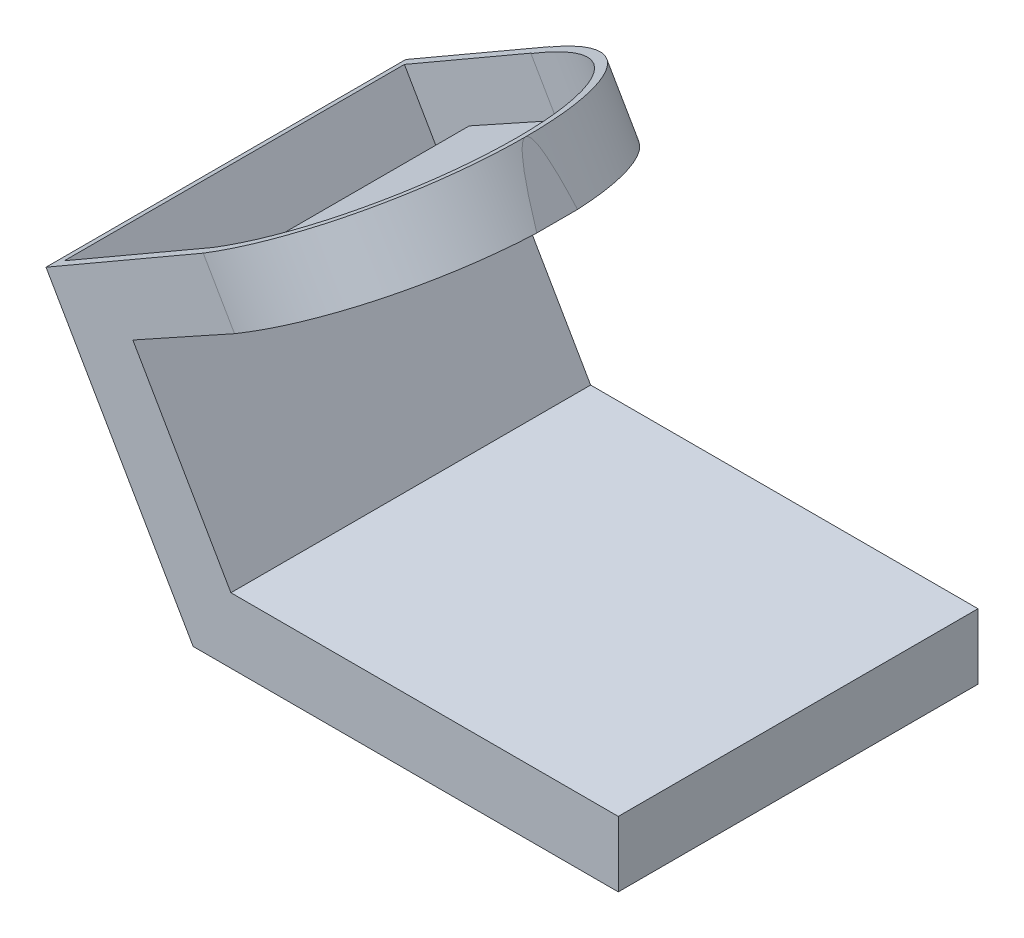
ISO-10303-21;
HEADER;
FILE_DESCRIPTION(('STEP AP214'),'2;1');
FILE_NAME('part.step','',(''),(''),'','','');
FILE_SCHEMA(('AUTOMOTIVE_DESIGN { 1 0 10303 214 1 1 1 1 }'));
ENDSEC;
DATA;
#1=APPLICATION_CONTEXT('core data for automotive mechanical design processes');
#2=APPLICATION_PROTOCOL_DEFINITION('international standard','automotive_design',2000,#1);
#3=PRODUCT_CONTEXT('',#1,'mechanical');
#4=PRODUCT('Part','Part','',(#3));
#5=PRODUCT_RELATED_PRODUCT_CATEGORY('part','',(#4));
#6=PRODUCT_DEFINITION_FORMATION('','',#4);
#7=PRODUCT_DEFINITION_CONTEXT('part definition',#1,'design');
#8=PRODUCT_DEFINITION('design','',#6,#7);
#9=PRODUCT_DEFINITION_SHAPE('','',#8);
#10=(LENGTH_UNIT() NAMED_UNIT(*) SI_UNIT(.MILLI.,.METRE.));
#11=(NAMED_UNIT(*) PLANE_ANGLE_UNIT() SI_UNIT($,.RADIAN.));
#12=(NAMED_UNIT(*) SI_UNIT($,.STERADIAN.) SOLID_ANGLE_UNIT());
#13=UNCERTAINTY_MEASURE_WITH_UNIT(LENGTH_MEASURE(1.E-05),#10,'distance_accuracy_value','');
#14=(GEOMETRIC_REPRESENTATION_CONTEXT(3) GLOBAL_UNCERTAINTY_ASSIGNED_CONTEXT((#13)) GLOBAL_UNIT_ASSIGNED_CONTEXT((#10,
#11,#12)) REPRESENTATION_CONTEXT('',''));
#15=CARTESIAN_POINT('',(0.,0.,0.));
#16=DIRECTION('',(0.,0.,1.));
#17=DIRECTION('',(1.,0.,0.));
#18=AXIS2_PLACEMENT_3D('',#15,#16,#17);
#19=CARTESIAN_POINT('',(46.7986928011498,130.9422863406,110.));
#20=DIRECTION('',(-0.874743269355894,-0.484586641083472,0.));
#21=DIRECTION('',(0.484586641083472,-0.874743269355894,0.));
#22=AXIS2_PLACEMENT_3D('',#19,#20,#21);
#23=PLANE('',#22);
#24=CARTESIAN_POINT('',(1551.95620112829,-2586.06699147574,55.1869746386134));
#25=DIRECTION('',(-0.874743269355894,-0.484586641083472,0.));
#26=DIRECTION('',(-0.484586641083472,0.874743269355894,0.));
#27=AXIS2_PLACEMENT_3D('',#24,#25,#26);
#28=ELLIPSE('',#27,3106.06479980918,55.);
#29=CARTESIAN_POINT('',(56.4904256228193,113.447420953482,48.9555521950042));
#30=VERTEX_POINT('',#29);
#31=CARTESIAN_POINT('',(46.7986928011498,130.9422863406,55.1869746386134));
#32=VERTEX_POINT('',#31);
#33=EDGE_CURVE('E343',#30,#32,#28,.F.);
#34=ORIENTED_EDGE('',*,*,#33,.T.);
#35=CARTESIAN_POINT('',(56.4904256228193,113.447420953482,61.4183970822225));
#36=VERTEX_POINT('',#35);
#37=EDGE_CURVE('E338',#32,#36,#28,.F.);
#38=ORIENTED_EDGE('',*,*,#37,.T.);
#39=DIRECTION('',(0.,0.,-1.));
#40=VECTOR('',#39,1.);
#41=CARTESIAN_POINT('',(56.4904256228193,113.447420953482,110.));
#42=LINE('',#41,#40);
#43=EDGE_CURVE('E394',#36,#30,#42,.T.);
#44=ORIENTED_EDGE('',*,*,#43,.T.);
#45=EDGE_LOOP('',(#34,#38,#44));
#46=FACE_BOUND('',#45,.T.);
#47=ADVANCED_FACE('F45',(#46),#23,.F.);
#48=CARTESIAN_POINT('',(0.,0.,110.));
#49=DIRECTION('',(0.866025403784436,0.500000000000004,0.));
#50=DIRECTION('',(-0.500000000000004,0.866025403784436,0.));
#51=AXIS2_PLACEMENT_3D('',#48,#49,#50);
#52=PLANE('',#51);
#53=DIRECTION('',(0.500000000000004,-0.866025403784436,0.));
#54=VECTOR('',#53,1.);
#55=CARTESIAN_POINT('',(0.,0.,0.));
#56=LINE('',#55,#54);
#57=CARTESIAN_POINT('',(-45.0000000000004,77.9422863405993,0.));
#58=VERTEX_POINT('',#57);
#59=CARTESIAN_POINT('',(0.,0.,0.));
#60=VERTEX_POINT('',#59);
#61=EDGE_CURVE('E369',#58,#60,#56,.T.);
#62=ORIENTED_EDGE('',*,*,#61,.T.);
#63=DIRECTION('',(0.,0.,-1.));
#64=VECTOR('',#63,1.);
#65=CARTESIAN_POINT('',(0.,0.,110.));
#66=LINE('',#65,#64);
#67=CARTESIAN_POINT('',(0.,0.,110.));
#68=VERTEX_POINT('',#67);
#69=EDGE_CURVE('E414',#68,#60,#66,.T.);
#70=ORIENTED_EDGE('',*,*,#69,.F.);
#71=DIRECTION('',(0.500000000000004,-0.866025403784436,0.));
#72=VECTOR('',#71,1.);
#73=CARTESIAN_POINT('',(0.,0.,110.));
#74=LINE('',#73,#72);
#75=CARTESIAN_POINT('',(-45.0000000000004,77.9422863405993,110.));
#76=VERTEX_POINT('',#75);
#77=EDGE_CURVE('E344',#76,#68,#74,.T.);
#78=ORIENTED_EDGE('',*,*,#77,.F.);
#79=DIRECTION('',(0.,0.,-1.));
#80=VECTOR('',#79,1.);
#81=CARTESIAN_POINT('',(-45.0000000000004,77.9422863405993,110.));
#82=LINE('',#81,#80);
#83=EDGE_CURVE('E368',#76,#58,#82,.T.);
#84=ORIENTED_EDGE('',*,*,#83,.T.);
#85=EDGE_LOOP('',(#62,#70,#78,#84));
#86=FACE_BOUND('',#85,.T.);
#87=ADVANCED_FACE('F47',(#86),#52,.F.);
#88=CARTESIAN_POINT('',(0.,0.,110.));
#89=DIRECTION('',(0.,1.,0.));
#90=DIRECTION('',(0.,0.,1.));
#91=AXIS2_PLACEMENT_3D('',#88,#89,#90);
#92=PLANE('',#91);
#93=DIRECTION('',(1.,0.,0.));
#94=VECTOR('',#93,1.);
#95=CARTESIAN_POINT('',(0.,0.,0.));
#96=LINE('',#95,#94);
#97=CARTESIAN_POINT('',(130.,0.,0.));
#98=VERTEX_POINT('',#97);
#99=EDGE_CURVE('E373',#60,#98,#96,.T.);
#100=ORIENTED_EDGE('',*,*,#99,.T.);
#101=DIRECTION('',(0.,0.,-1.));
#102=VECTOR('',#101,1.);
#103=CARTESIAN_POINT('',(130.,0.,110.));
#104=LINE('',#103,#102);
#105=CARTESIAN_POINT('',(130.,0.,110.));
#106=VERTEX_POINT('',#105);
#107=EDGE_CURVE('E410',#106,#98,#104,.T.);
#108=ORIENTED_EDGE('',*,*,#107,.F.);
#109=DIRECTION('',(1.,0.,0.));
#110=VECTOR('',#109,1.);
#111=CARTESIAN_POINT('',(0.,0.,110.));
#112=LINE('',#111,#110);
#113=EDGE_CURVE('E348',#68,#106,#112,.T.);
#114=ORIENTED_EDGE('',*,*,#113,.F.);
#115=ORIENTED_EDGE('',*,*,#69,.T.);
#116=EDGE_LOOP('',(#100,#108,#114,#115));
#117=FACE_BOUND('',#116,.T.);
#118=ADVANCED_FACE('F467',(#117),#92,.F.);
#119=CARTESIAN_POINT('',(130.,0.,110.));
#120=DIRECTION('',(-1.,0.,0.));
#121=DIRECTION('',(0.,0.,1.));
#122=AXIS2_PLACEMENT_3D('',#119,#120,#121);
#123=PLANE('',#122);
#124=DIRECTION('',(0.,1.,0.));
#125=VECTOR('',#124,1.);
#126=CARTESIAN_POINT('',(130.,0.,0.));
#127=LINE('',#126,#125);
#128=CARTESIAN_POINT('',(130.,20.,0.));
#129=VERTEX_POINT('',#128);
#130=EDGE_CURVE('E376',#98,#129,#127,.T.);
#131=ORIENTED_EDGE('',*,*,#130,.T.);
#132=DIRECTION('',(0.,0.,-1.));
#133=VECTOR('',#132,1.);
#134=CARTESIAN_POINT('',(130.,20.,110.));
#135=LINE('',#134,#133);
#136=CARTESIAN_POINT('',(130.,20.,110.));
#137=VERTEX_POINT('',#136);
#138=EDGE_CURVE('E406',#137,#129,#135,.T.);
#139=ORIENTED_EDGE('',*,*,#138,.F.);
#140=DIRECTION('',(0.,1.,0.));
#141=VECTOR('',#140,1.);
#142=CARTESIAN_POINT('',(130.,0.,110.));
#143=LINE('',#142,#141);
#144=EDGE_CURVE('E352',#106,#137,#143,.T.);
#145=ORIENTED_EDGE('',*,*,#144,.F.);
#146=ORIENTED_EDGE('',*,*,#107,.T.);
#147=EDGE_LOOP('',(#131,#139,#145,#146));
#148=FACE_BOUND('',#147,.T.);
#149=ADVANCED_FACE('F464',(#148),#123,.F.);
#150=CARTESIAN_POINT('',(130.,20.,110.));
#151=DIRECTION('',(0.,-1.,0.));
#152=DIRECTION('',(1.,0.,0.));
#153=AXIS2_PLACEMENT_3D('',#150,#151,#152);
#154=PLANE('',#153);
#155=DIRECTION('',(-1.,0.,0.));
#156=VECTOR('',#155,1.);
#157=CARTESIAN_POINT('',(130.,20.,0.));
#158=LINE('',#157,#156);
#159=CARTESIAN_POINT('',(11.5470053837925,20.,0.));
#160=VERTEX_POINT('',#159);
#161=EDGE_CURVE('E379',#129,#160,#158,.T.);
#162=ORIENTED_EDGE('',*,*,#161,.T.);
#163=DIRECTION('',(0.,0.,-1.));
#164=VECTOR('',#163,1.);
#165=CARTESIAN_POINT('',(11.5470053837925,20.,110.));
#166=LINE('',#165,#164);
#167=CARTESIAN_POINT('',(11.5470053837925,20.,110.));
#168=VERTEX_POINT('',#167);
#169=EDGE_CURVE('E402',#168,#160,#166,.T.);
#170=ORIENTED_EDGE('',*,*,#169,.F.);
#171=DIRECTION('',(-1.,0.,0.));
#172=VECTOR('',#171,1.);
#173=CARTESIAN_POINT('',(130.,20.,110.));
#174=LINE('',#173,#172);
#175=EDGE_CURVE('E355',#137,#168,#174,.T.);
#176=ORIENTED_EDGE('',*,*,#175,.F.);
#177=ORIENTED_EDGE('',*,*,#138,.T.);
#178=EDGE_LOOP('',(#162,#170,#176,#177));
#179=FACE_BOUND('',#178,.T.);
#180=ADVANCED_FACE('F460',(#179),#154,.F.);
#181=CARTESIAN_POINT('',(11.5470053837925,20.,110.));
#182=DIRECTION('',(-0.866025403784436,-0.500000000000005,0.));
#183=DIRECTION('',(0.500000000000005,-0.866025403784436,0.));
#184=AXIS2_PLACEMENT_3D('',#181,#182,#183);
#185=PLANE('',#184);
#186=DIRECTION('',(-0.500000000000005,0.866025403784436,0.));
#187=VECTOR('',#186,1.);
#188=CARTESIAN_POINT('',(11.5470053837925,20.,0.));
#189=LINE('',#188,#187);
#190=CARTESIAN_POINT('',(-18.4394568185094,71.93807607363,0.));
#191=VERTEX_POINT('',#190);
#192=EDGE_CURVE('E382',#160,#191,#189,.T.);
#193=ORIENTED_EDGE('',*,*,#192,.T.);
#194=DIRECTION('',(0.,0.,-1.));
#195=VECTOR('',#194,1.);
#196=CARTESIAN_POINT('',(-18.4394568185094,71.93807607363,110.));
#197=LINE('',#196,#195);
#198=CARTESIAN_POINT('',(-18.4394568185094,71.93807607363,110.));
#199=VERTEX_POINT('',#198);
#200=EDGE_CURVE('E398',#199,#191,#197,.T.);
#201=ORIENTED_EDGE('',*,*,#200,.F.);
#202=DIRECTION('',(-0.500000000000005,0.866025403784436,0.));
#203=VECTOR('',#202,1.);
#204=CARTESIAN_POINT('',(11.5470053837925,20.,110.));
#205=LINE('',#204,#203);
#206=EDGE_CURVE('E358',#168,#199,#205,.T.);
#207=ORIENTED_EDGE('',*,*,#206,.F.);
#208=ORIENTED_EDGE('',*,*,#169,.T.);
#209=EDGE_LOOP('',(#193,#201,#207,#208));
#210=FACE_BOUND('',#209,.T.);
#211=ADVANCED_FACE('F455',(#210),#185,.F.);
#212=CARTESIAN_POINT('',(56.4904256228193,113.447420953482,110.));
#213=DIRECTION('',(-0.484586641083472,0.874743269355894,0.));
#214=DIRECTION('',(-0.874743269355894,-0.484586641083472,0.));
#215=AXIS2_PLACEMENT_3D('',#212,#213,#214);
#216=PLANE('',#215);
#217=CARTESIAN_POINT('',(8.39408348075906,86.8032092132942,55.095));
#218=DIRECTION('',(-0.484586641083472,0.874743269355894,0.));
#219=DIRECTION('',(-0.874743269355894,-0.484586641083472,0.));
#220=AXIS2_PLACEMENT_3D('',#217,#218,#219);
#221=CIRCLE('',#220,9.5);
#222=CARTESIAN_POINT('',(0.0840224218780702,82.1996361230012,55.095));
#223=VERTEX_POINT('',#222);
#224=EDGE_CURVE('E301',#223,#223,#221,.T.);
#225=ORIENTED_EDGE('',*,*,#224,.T.);
#226=EDGE_LOOP('',(#225));
#227=FACE_BOUND('',#226,.T.);
#228=ORIENTED_EDGE('',*,*,#43,.F.);
#229=CARTESIAN_POINT('',(8.68183678168936,86.962617591093,55.1869746386134));
#230=DIRECTION('',(-0.484586641083472,0.874743269355894,0.));
#231=DIRECTION('',(-0.874743269355894,-0.484586641083472,0.));
#232=AXIS2_PLACEMENT_3D('',#229,#230,#231);
#233=ELLIPSE('',#232,55.0086246045841,55.);
#234=CARTESIAN_POINT('',(12.6461411029082,89.1587464240324,110.));
#235=VERTEX_POINT('',#234);
#236=EDGE_CURVE('E334',#36,#235,#233,.F.);
#237=ORIENTED_EDGE('',*,*,#236,.T.);
#238=DIRECTION('',(0.874743269355894,0.484586641083472,0.));
#239=VECTOR('',#238,1.);
#240=CARTESIAN_POINT('',(56.4904256228193,113.447420953482,110.));
#241=LINE('',#240,#239);
#242=EDGE_CURVE('E361',#199,#235,#241,.T.);
#243=ORIENTED_EDGE('',*,*,#242,.F.);
#244=ORIENTED_EDGE('',*,*,#200,.T.);
#245=DIRECTION('',(0.874743269355894,0.484586641083472,0.));
#246=VECTOR('',#245,1.);
#247=CARTESIAN_POINT('',(56.4904256228193,113.447420953482,0.));
#248=LINE('',#247,#246);
#249=CARTESIAN_POINT('',(8.68183678168936,86.9626175910931,0.));
#250=VERTEX_POINT('',#249);
#251=EDGE_CURVE('E385',#191,#250,#248,.T.);
#252=ORIENTED_EDGE('',*,*,#251,.T.);
#253=DIRECTION('',(0.,0.,1.));
#254=VECTOR('',#253,1.);
#255=CARTESIAN_POINT('',(8.68183678169064,86.9626175910937,110.000000000001));
#256=LINE('',#255,#254);
#257=CARTESIAN_POINT('',(8.68183678168938,86.962617591093,0.186974638613363));
#258=VERTEX_POINT('',#257);
#259=EDGE_CURVE('E70',#250,#258,#256,.T.);
#260=ORIENTED_EDGE('',*,*,#259,.T.);
#261=EDGE_CURVE('E339',#258,#30,#233,.F.);
#262=ORIENTED_EDGE('',*,*,#261,.T.);
#263=EDGE_LOOP('',(#228,#237,#243,#244,#252,#260,#262));
#264=FACE_BOUND('',#263,.T.);
#265=ADVANCED_FACE('F443',(#227,#264),#216,.F.);
#266=CARTESIAN_POINT('',(-45.0000000000004,77.9422863405993,110.));
#267=DIRECTION('',(0.500000000000004,-0.866025403784436,0.));
#268=DIRECTION('',(0.866025403784436,0.500000000000004,0.));
#269=AXIS2_PLACEMENT_3D('',#266,#267,#268);
#270=PLANE('',#269);
#271=CARTESIAN_POINT('',(-0.832704406994143,103.442286340599,55.1869746386134));
#272=DIRECTION('',(0.500000000000004,-0.866025403784436,0.));
#273=DIRECTION('',(0.866025403784436,0.500000000000004,0.));
#274=AXIS2_PLACEMENT_3D('',#271,#272,#273);
#275=CIRCLE('',#274,52.);
#276=CARTESIAN_POINT('',(2.98276439450761,105.645148280231,107.));
#277=VERTEX_POINT('',#276);
#278=CARTESIAN_POINT('',(44.2002091828874,129.442051124111,55.4081641689637));
#279=VERTEX_POINT('',#278);
#280=EDGE_CURVE('E250',#277,#279,#275,.F.);
#281=ORIENTED_EDGE('',*,*,#280,.F.);
#282=DIRECTION('',(-0.866025403784436,-0.500000000000004,0.));
#283=VECTOR('',#282,1.);
#284=CARTESIAN_POINT('',(-45.0000000000004,77.9422863405993,107.));
#285=LINE('',#284,#283);
#286=CARTESIAN_POINT('',(-42.4019237886471,79.4422863405993,107.));
#287=VERTEX_POINT('',#286);
#288=EDGE_CURVE('E231',#277,#287,#285,.T.);
#289=ORIENTED_EDGE('',*,*,#288,.T.);
#290=DIRECTION('',(0.,0.,-1.));
#291=VECTOR('',#290,1.);
#292=CARTESIAN_POINT('',(-42.4019237886471,79.4422863405993,110.));
#293=LINE('',#292,#291);
#294=CARTESIAN_POINT('',(-42.4019237886471,79.4422863405993,3.));
#295=VERTEX_POINT('',#294);
#296=EDGE_CURVE('E223',#287,#295,#293,.T.);
#297=ORIENTED_EDGE('',*,*,#296,.T.);
#298=DIRECTION('',(-0.866025403784436,-0.500000000000004,0.));
#299=VECTOR('',#298,1.);
#300=CARTESIAN_POINT('',(-45.0000000000004,77.9422863405993,3.));
#301=LINE('',#300,#299);
#302=CARTESIAN_POINT('',(-3.43078061834741,101.942286340599,3.));
#303=VERTEX_POINT('',#302);
#304=EDGE_CURVE('E246',#303,#295,#301,.T.);
#305=ORIENTED_EDGE('',*,*,#304,.F.);
#306=DIRECTION('',(0.,0.,-1.));
#307=VECTOR('',#306,1.);
#308=CARTESIAN_POINT('',(-3.4307806183462,101.9422863406,109.999999999999));
#309=LINE('',#308,#307);
#310=CARTESIAN_POINT('',(-3.43078061834741,101.942286340599,3.27358522894373));
#311=VERTEX_POINT('',#310);
#312=EDGE_CURVE('E251',#311,#303,#309,.T.);
#313=ORIENTED_EDGE('',*,*,#312,.F.);
#314=CARTESIAN_POINT('',(-0.832704406994143,103.442286340599,55.1869746386134));
#315=DIRECTION('',(0.500000000000004,-0.866025403784436,0.));
#316=DIRECTION('',(0.866025403784436,0.500000000000004,0.));
#317=AXIS2_PLACEMENT_3D('',#314,#315,#316);
#318=CIRCLE('',#317,52.);
#319=CARTESIAN_POINT('',(44.2002091828877,129.44205112411,54.9657851082632));
#320=VERTEX_POINT('',#319);
#321=EDGE_CURVE('E237',#320,#311,#318,.F.);
#322=ORIENTED_EDGE('',*,*,#321,.F.);
#323=DIRECTION('',(0.,0.,-1.));
#324=VECTOR('',#323,1.);
#325=CARTESIAN_POINT('',(44.2002091828874,129.442051124111,110.));
#326=LINE('',#325,#324);
#327=EDGE_CURVE('E201',#279,#320,#326,.T.);
#328=ORIENTED_EDGE('',*,*,#327,.F.);
#329=EDGE_LOOP('',(#281,#289,#297,#305,#313,#322,#328));
#330=FACE_BOUND('',#329,.T.);
#331=DIRECTION('',(-0.866025403784436,-0.500000000000004,0.));
#332=VECTOR('',#331,1.);
#333=CARTESIAN_POINT('',(-45.0000000000004,77.9422863405993,110.));
#334=LINE('',#333,#332);
#335=CARTESIAN_POINT('',(3.09147551357442,105.707912674088,110.));
#336=VERTEX_POINT('',#335);
#337=EDGE_CURVE('E365',#336,#76,#334,.T.);
#338=ORIENTED_EDGE('',*,*,#337,.F.);
#339=CARTESIAN_POINT('',(-0.832704406994143,103.442286340599,55.1869746386134));
#340=DIRECTION('',(0.500000000000004,-0.866025403784436,0.));
#341=DIRECTION('',(0.866025403784436,0.500000000000004,0.));
#342=AXIS2_PLACEMENT_3D('',#339,#340,#341);
#343=CIRCLE('',#342,55.);
#344=EDGE_CURVE('E329',#336,#32,#343,.F.);
#345=ORIENTED_EDGE('',*,*,#344,.T.);
#346=CARTESIAN_POINT('',(-0.832704406994136,103.442286340599,0.186974638613363));
#347=VERTEX_POINT('',#346);
#348=EDGE_CURVE('E333',#32,#347,#343,.F.);
#349=ORIENTED_EDGE('',*,*,#348,.T.);
#350=DIRECTION('',(0.,0.,-1.));
#351=VECTOR('',#350,1.);
#352=CARTESIAN_POINT('',(-0.83270440699288,103.4422863406,109.999999999999));
#353=LINE('',#352,#351);
#354=CARTESIAN_POINT('',(-0.832704406994171,103.442286340599,0.));
#355=VERTEX_POINT('',#354);
#356=EDGE_CURVE('E323',#347,#355,#353,.T.);
#357=ORIENTED_EDGE('',*,*,#356,.T.);
#358=DIRECTION('',(-0.866025403784436,-0.500000000000004,0.));
#359=VECTOR('',#358,1.);
#360=CARTESIAN_POINT('',(-45.0000000000004,77.9422863405993,0.));
#361=LINE('',#360,#359);
#362=EDGE_CURVE('E349',#355,#58,#361,.T.);
#363=ORIENTED_EDGE('',*,*,#362,.T.);
#364=ORIENTED_EDGE('',*,*,#83,.F.);
#365=EDGE_LOOP('',(#338,#345,#349,#357,#363,#364));
#366=FACE_BOUND('',#365,.T.);
#367=ADVANCED_FACE('F426',(#330,#366),#270,.F.);
#368=CARTESIAN_POINT('',(0.,0.,110.));
#369=DIRECTION('',(0.,0.,-1.));
#370=DIRECTION('',(-1.,0.,0.));
#371=AXIS2_PLACEMENT_3D('',#368,#369,#370);
#372=PLANE('',#371);
#373=ORIENTED_EDGE('',*,*,#242,.T.);
#374=DIRECTION('',(-0.500000000000004,0.866025403784436,0.));
#375=VECTOR('',#374,1.);
#376=CARTESIAN_POINT('',(30.5914755135746,58.0765154659443,110.));
#377=LINE('',#376,#375);
#378=EDGE_CURVE('E11',#235,#336,#377,.T.);
#379=ORIENTED_EDGE('',*,*,#378,.T.);
#380=ORIENTED_EDGE('',*,*,#337,.T.);
#381=ORIENTED_EDGE('',*,*,#77,.T.);
#382=ORIENTED_EDGE('',*,*,#113,.T.);
#383=ORIENTED_EDGE('',*,*,#144,.T.);
#384=ORIENTED_EDGE('',*,*,#175,.T.);
#385=ORIENTED_EDGE('',*,*,#206,.T.);
#386=EDGE_LOOP('',(#373,#379,#380,#381,#382,#383,#384,#385));
#387=FACE_BOUND('',#386,.T.);
#388=ADVANCED_FACE('F437',(#387),#372,.F.);
#389=CARTESIAN_POINT('',(0.,0.,0.));
#390=DIRECTION('',(0.,0.,-1.));
#391=DIRECTION('',(-1.,0.,0.));
#392=AXIS2_PLACEMENT_3D('',#389,#390,#391);
#393=PLANE('',#392);
#394=DIRECTION('',(-0.500000000000005,0.866025403784436,0.));
#395=VECTOR('',#394,1.);
#396=CARTESIAN_POINT('',(44.1672955930062,25.5000000000002,0.));
#397=LINE('',#396,#395);
#398=EDGE_CURVE('E55',#250,#355,#397,.T.);
#399=ORIENTED_EDGE('',*,*,#398,.F.);
#400=ORIENTED_EDGE('',*,*,#251,.F.);
#401=ORIENTED_EDGE('',*,*,#192,.F.);
#402=ORIENTED_EDGE('',*,*,#161,.F.);
#403=ORIENTED_EDGE('',*,*,#130,.F.);
#404=ORIENTED_EDGE('',*,*,#99,.F.);
#405=ORIENTED_EDGE('',*,*,#61,.F.);
#406=ORIENTED_EDGE('',*,*,#362,.F.);
#407=EDGE_LOOP('',(#399,#400,#401,#402,#403,#404,#405,#406));
#408=FACE_BOUND('',#407,.T.);
#409=ADVANCED_FACE('F430',(#408),#393,.T.);
#410=CARTESIAN_POINT('',(26.6672955930059,55.8108891324554,-14.4372968712858));
#411=DIRECTION('',(-0.866025403784436,-0.500000000000004,0.));
#412=DIRECTION('',(0.500000000000005,-0.866025403784436,0.));
#413=AXIS2_PLACEMENT_3D('',#410,#411,#412);
#414=PLANE('',#413);
#415=ORIENTED_EDGE('',*,*,#398,.T.);
#416=ORIENTED_EDGE('',*,*,#356,.F.);
#417=DIRECTION('',(-0.500000000000004,0.866025403784436,0.));
#418=VECTOR('',#417,1.);
#419=CARTESIAN_POINT('',(26.6672955930061,55.8108891324555,0.186974638613363));
#420=LINE('',#419,#418);
#421=EDGE_CURVE('E319',#258,#347,#420,.T.);
#422=ORIENTED_EDGE('',*,*,#421,.F.);
#423=ORIENTED_EDGE('',*,*,#259,.F.);
#424=EDGE_LOOP('',(#415,#416,#422,#423));
#425=FACE_BOUND('',#424,.T.);
#426=ADVANCED_FACE('F419',(#425),#414,.F.);
#427=CARTESIAN_POINT('',(26.6672955930061,55.8108891324555,55.1869746386134));
#428=DIRECTION('',(-0.500000000000004,0.866025403784436,0.));
#429=DIRECTION('',(-0.866025403784436,-0.500000000000005,0.));
#430=AXIS2_PLACEMENT_3D('',#427,#428,#429);
#431=CYLINDRICAL_SURFACE('',#430,55.);
#432=ORIENTED_EDGE('',*,*,#421,.T.);
#433=ORIENTED_EDGE('',*,*,#348,.F.);
#434=ORIENTED_EDGE('',*,*,#33,.F.);
#435=ORIENTED_EDGE('',*,*,#261,.F.);
#436=EDGE_LOOP('',(#432,#433,#434,#435));
#437=FACE_BOUND('',#436,.T.);
#438=ADVANCED_FACE('F447',(#437),#431,.T.);
#439=ORIENTED_EDGE('',*,*,#344,.F.);
#440=ORIENTED_EDGE('',*,*,#378,.F.);
#441=ORIENTED_EDGE('',*,*,#236,.F.);
#442=ORIENTED_EDGE('',*,*,#37,.F.);
#443=EDGE_LOOP('',(#439,#440,#441,#442));
#444=FACE_BOUND('',#443,.T.);
#445=ADVANCED_FACE('F440',(#444),#431,.T.);
#446=CARTESIAN_POINT('',(44.1744629930822,129.488526417349,110.));
#447=DIRECTION('',(-0.874743269355894,-0.484586641083472,0.));
#448=DIRECTION('',(0.484586641083472,-0.874743269355894,0.));
#449=AXIS2_PLACEMENT_3D('',#446,#447,#448);
#450=PLANE('',#449);
#451=CARTESIAN_POINT('',(1467.24534295167,-2439.34348116109,55.1869746386134));
#452=DIRECTION('',(-0.874743269355894,-0.484586641083472,0.));
#453=DIRECTION('',(-0.484586641083472,0.874743269355894,0.));
#454=AXIS2_PLACEMENT_3D('',#451,#452,#453);
#455=ELLIPSE('',#454,2936.64308345595,52.);
#456=CARTESIAN_POINT('',(52.4124358915012,114.617890838299,49.6042114808415));
#457=VERTEX_POINT('',#456);
#458=EDGE_CURVE('E195',#457,#320,#455,.F.);
#459=ORIENTED_EDGE('',*,*,#458,.F.);
#460=DIRECTION('',(0.,0.,-1.));
#461=VECTOR('',#460,1.);
#462=CARTESIAN_POINT('',(52.4124358915012,114.617890838299,110.));
#463=LINE('',#462,#461);
#464=CARTESIAN_POINT('',(52.4124358915012,114.617890838299,60.7697377963853));
#465=VERTEX_POINT('',#464);
#466=EDGE_CURVE('E199',#465,#457,#463,.T.);
#467=ORIENTED_EDGE('',*,*,#466,.F.);
#468=CARTESIAN_POINT('',(1467.24534295167,-2439.34348116109,55.1869746386134));
#469=DIRECTION('',(-0.874743269355894,-0.484586641083472,0.));
#470=DIRECTION('',(-0.484586641083472,0.874743269355894,0.));
#471=AXIS2_PLACEMENT_3D('',#468,#469,#470);
#472=ELLIPSE('',#471,2936.64308345595,52.);
#473=EDGE_CURVE('E207',#279,#465,#472,.F.);
#474=ORIENTED_EDGE('',*,*,#473,.F.);
#475=ORIENTED_EDGE('',*,*,#327,.T.);
#476=EDGE_LOOP('',(#459,#467,#474,#475));
#477=FACE_BOUND('',#476,.T.);
#478=ADVANCED_FACE('F197',(#477),#450,.T.);
#479=CARTESIAN_POINT('',(2.59807621135331,1.50000000000001,110.));
#480=DIRECTION('',(0.866025403784436,0.500000000000004,0.));
#481=DIRECTION('',(-0.500000000000004,0.866025403784436,0.));
#482=AXIS2_PLACEMENT_3D('',#479,#480,#481);
#483=PLANE('',#482);
#484=DIRECTION('',(0.500000000000004,-0.866025403784436,0.));
#485=VECTOR('',#484,1.);
#486=CARTESIAN_POINT('',(2.59807621135331,1.50000000000001,3.));
#487=LINE('',#486,#485);
#488=CARTESIAN_POINT('',(1.73205080756887,3.,3.));
#489=VERTEX_POINT('',#488);
#490=EDGE_CURVE('E62',#295,#489,#487,.T.);
#491=ORIENTED_EDGE('',*,*,#490,.F.);
#492=ORIENTED_EDGE('',*,*,#296,.F.);
#493=DIRECTION('',(0.500000000000004,-0.866025403784436,0.));
#494=VECTOR('',#493,1.);
#495=CARTESIAN_POINT('',(2.59807621135331,1.50000000000001,107.));
#496=LINE('',#495,#494);
#497=CARTESIAN_POINT('',(1.73205080756887,3.,107.));
#498=VERTEX_POINT('',#497);
#499=EDGE_CURVE('E287',#287,#498,#496,.T.);
#500=ORIENTED_EDGE('',*,*,#499,.T.);
#501=DIRECTION('',(0.,0.,-1.));
#502=VECTOR('',#501,1.);
#503=CARTESIAN_POINT('',(1.73205080756887,3.,110.));
#504=LINE('',#503,#502);
#505=EDGE_CURVE('E282',#498,#489,#504,.T.);
#506=ORIENTED_EDGE('',*,*,#505,.T.);
#507=EDGE_LOOP('',(#491,#492,#500,#506));
#508=FACE_BOUND('',#507,.T.);
#509=ADVANCED_FACE('F564',(#508),#483,.T.);
#510=CARTESIAN_POINT('',(0.,3.,110.));
#511=DIRECTION('',(0.,1.,0.));
#512=DIRECTION('',(0.,0.,1.));
#513=AXIS2_PLACEMENT_3D('',#510,#511,#512);
#514=PLANE('',#513);
#515=DIRECTION('',(1.,0.,0.));
#516=VECTOR('',#515,1.);
#517=CARTESIAN_POINT('',(0.,3.,3.));
#518=LINE('',#517,#516);
#519=CARTESIAN_POINT('',(127.,3.,3.));
#520=VERTEX_POINT('',#519);
#521=EDGE_CURVE('E275',#489,#520,#518,.T.);
#522=ORIENTED_EDGE('',*,*,#521,.F.);
#523=ORIENTED_EDGE('',*,*,#505,.F.);
#524=DIRECTION('',(1.,0.,0.));
#525=VECTOR('',#524,1.);
#526=CARTESIAN_POINT('',(0.,3.,107.));
#527=LINE('',#526,#525);
#528=CARTESIAN_POINT('',(127.,3.,107.));
#529=VERTEX_POINT('',#528);
#530=EDGE_CURVE('E278',#498,#529,#527,.T.);
#531=ORIENTED_EDGE('',*,*,#530,.T.);
#532=DIRECTION('',(0.,0.,-1.));
#533=VECTOR('',#532,1.);
#534=CARTESIAN_POINT('',(127.,3.,110.));
#535=LINE('',#534,#533);
#536=EDGE_CURVE('E272',#529,#520,#535,.T.);
#537=ORIENTED_EDGE('',*,*,#536,.T.);
#538=EDGE_LOOP('',(#522,#523,#531,#537));
#539=FACE_BOUND('',#538,.T.);
#540=ADVANCED_FACE('F573',(#539),#514,.T.);
#541=CARTESIAN_POINT('',(127.,0.,110.));
#542=DIRECTION('',(-1.,0.,0.));
#543=DIRECTION('',(0.,0.,1.));
#544=AXIS2_PLACEMENT_3D('',#541,#542,#543);
#545=PLANE('',#544);
#546=DIRECTION('',(0.,1.,0.));
#547=VECTOR('',#546,1.);
#548=CARTESIAN_POINT('',(127.,0.,3.));
#549=LINE('',#548,#547);
#550=CARTESIAN_POINT('',(127.,17.,3.));
#551=VERTEX_POINT('',#550);
#552=EDGE_CURVE('E265',#520,#551,#549,.T.);
#553=ORIENTED_EDGE('',*,*,#552,.F.);
#554=ORIENTED_EDGE('',*,*,#536,.F.);
#555=DIRECTION('',(0.,1.,0.));
#556=VECTOR('',#555,1.);
#557=CARTESIAN_POINT('',(127.,0.,107.));
#558=LINE('',#557,#556);
#559=CARTESIAN_POINT('',(127.,17.,107.));
#560=VERTEX_POINT('',#559);
#561=EDGE_CURVE('E268',#529,#560,#558,.T.);
#562=ORIENTED_EDGE('',*,*,#561,.T.);
#563=DIRECTION('',(0.,0.,-1.));
#564=VECTOR('',#563,1.);
#565=CARTESIAN_POINT('',(127.,17.,110.));
#566=LINE('',#565,#564);
#567=EDGE_CURVE('E262',#560,#551,#566,.T.);
#568=ORIENTED_EDGE('',*,*,#567,.T.);
#569=EDGE_LOOP('',(#553,#554,#562,#568));
#570=FACE_BOUND('',#569,.T.);
#571=ADVANCED_FACE('F582',(#570),#545,.T.);
#572=CARTESIAN_POINT('',(130.,17.,110.));
#573=DIRECTION('',(0.,-1.,0.));
#574=DIRECTION('',(1.,0.,0.));
#575=AXIS2_PLACEMENT_3D('',#572,#573,#574);
#576=PLANE('',#575);
#577=DIRECTION('',(-1.,0.,0.));
#578=VECTOR('',#577,1.);
#579=CARTESIAN_POINT('',(0.,17.,3.));
#580=LINE('',#579,#578);
#581=CARTESIAN_POINT('',(9.8149545762236,17.,3.));
#582=VERTEX_POINT('',#581);
#583=EDGE_CURVE('E255',#551,#582,#580,.T.);
#584=ORIENTED_EDGE('',*,*,#583,.F.);
#585=ORIENTED_EDGE('',*,*,#567,.F.);
#586=DIRECTION('',(-1.,0.,0.));
#587=VECTOR('',#586,1.);
#588=CARTESIAN_POINT('',(0.,17.,107.));
#589=LINE('',#588,#587);
#590=CARTESIAN_POINT('',(9.8149545762236,17.,107.));
#591=VERTEX_POINT('',#590);
#592=EDGE_CURVE('E258',#560,#591,#589,.T.);
#593=ORIENTED_EDGE('',*,*,#592,.T.);
#594=DIRECTION('',(0.,0.,-1.));
#595=VECTOR('',#594,1.);
#596=CARTESIAN_POINT('',(9.81495457622361,17.,110.));
#597=LINE('',#596,#595);
#598=EDGE_CURVE('E228',#591,#582,#597,.T.);
#599=ORIENTED_EDGE('',*,*,#598,.T.);
#600=EDGE_LOOP('',(#584,#585,#593,#599));
#601=FACE_BOUND('',#600,.T.);
#602=ADVANCED_FACE('F592',(#601),#576,.T.);
#603=CARTESIAN_POINT('',(8.94892917243916,18.5,110.));
#604=DIRECTION('',(-0.866025403784436,-0.500000000000005,0.));
#605=DIRECTION('',(0.500000000000005,-0.866025403784436,0.));
#606=AXIS2_PLACEMENT_3D('',#603,#604,#605);
#607=PLANE('',#606);
#608=DIRECTION('',(-0.500000000000005,0.866025403784436,0.));
#609=VECTOR('',#608,1.);
#610=CARTESIAN_POINT('',(14.7224318643354,8.50000000000009,3.));
#611=LINE('',#610,#609);
#612=CARTESIAN_POINT('',(-22.5643333511464,73.0825718031057,3.));
#613=VERTEX_POINT('',#612);
#614=EDGE_CURVE('E247',#582,#613,#611,.T.);
#615=ORIENTED_EDGE('',*,*,#614,.F.);
#616=ORIENTED_EDGE('',*,*,#598,.F.);
#617=DIRECTION('',(-0.500000000000005,0.866025403784436,0.));
#618=VECTOR('',#617,1.);
#619=CARTESIAN_POINT('',(14.7224318643354,8.50000000000009,107.));
#620=LINE('',#619,#618);
#621=CARTESIAN_POINT('',(-22.5643333511464,73.0825718031057,107.));
#622=VERTEX_POINT('',#621);
#623=EDGE_CURVE('E240',#591,#622,#620,.T.);
#624=ORIENTED_EDGE('',*,*,#623,.T.);
#625=DIRECTION('',(0.,0.,-1.));
#626=VECTOR('',#625,1.);
#627=CARTESIAN_POINT('',(-22.5643333511464,73.0825718031057,110.));
#628=LINE('',#627,#626);
#629=EDGE_CURVE('E222',#622,#613,#628,.T.);
#630=ORIENTED_EDGE('',*,*,#629,.T.);
#631=EDGE_LOOP('',(#615,#616,#624,#630));
#632=FACE_BOUND('',#631,.T.);
#633=ADVANCED_FACE('F602',(#632),#607,.T.);
#634=CARTESIAN_POINT('',(55.0366656995689,116.07165076155,110.));
#635=DIRECTION('',(-0.484586641083472,0.874743269355894,0.));
#636=DIRECTION('',(-0.874743269355894,-0.484586641083472,0.));
#637=AXIS2_PLACEMENT_3D('',#634,#635,#636);
#638=PLANE('',#637);
#639=CARTESIAN_POINT('',(6.94032355750864,89.4274390213619,55.095));
#640=DIRECTION('',(-0.484586641083472,0.874743269355894,0.));
#641=DIRECTION('',(-0.874743269355894,-0.484586641083472,0.));
#642=AXIS2_PLACEMENT_3D('',#639,#640,#641);
#643=CIRCLE('',#642,9.5);
#644=CARTESIAN_POINT('',(-1.36973750137235,84.8238659310689,55.095));
#645=VERTEX_POINT('',#644);
#646=EDGE_CURVE('E49',#645,#645,#643,.T.);
#647=ORIENTED_EDGE('',*,*,#646,.F.);
#648=EDGE_LOOP('',(#647));
#649=FACE_BOUND('',#648,.T.);
#650=ORIENTED_EDGE('',*,*,#466,.T.);
#651=CARTESIAN_POINT('',(7.18160156520069,89.5611012093555,55.1869746386134));
#652=DIRECTION('',(-0.484586641083472,0.874743269355894,0.));
#653=DIRECTION('',(-0.874743269355894,-0.484586641083472,0.));
#654=AXIS2_PLACEMENT_3D('',#651,#652,#653);
#655=ELLIPSE('',#654,52.0081541716068,52.);
#656=CARTESIAN_POINT('',(4.55696024905246,88.1071133205688,3.27358522894373));
#657=VERTEX_POINT('',#656);
#658=EDGE_CURVE('E206',#657,#457,#655,.F.);
#659=ORIENTED_EDGE('',*,*,#658,.F.);
#660=DIRECTION('',(0.,0.,1.));
#661=VECTOR('',#660,1.);
#662=CARTESIAN_POINT('',(4.55696024905369,88.1071133205695,110.000000000001));
#663=LINE('',#662,#661);
#664=CARTESIAN_POINT('',(4.55696024905246,88.1071133205688,3.));
#665=VERTEX_POINT('',#664);
#666=EDGE_CURVE('E248',#665,#657,#663,.T.);
#667=ORIENTED_EDGE('',*,*,#666,.F.);
#668=DIRECTION('',(0.874743269355894,0.484586641083472,0.));
#669=VECTOR('',#668,1.);
#670=CARTESIAN_POINT('',(-36.277542983321,65.4857849206845,3.));
#671=LINE('',#670,#669);
#672=EDGE_CURVE('E242',#613,#665,#671,.T.);
#673=ORIENTED_EDGE('',*,*,#672,.F.);
#674=ORIENTED_EDGE('',*,*,#629,.F.);
#675=DIRECTION('',(0.874743269355894,0.484586641083472,0.));
#676=VECTOR('',#675,1.);
#677=CARTESIAN_POINT('',(-36.277542983321,65.4857849206845,107.));
#678=LINE('',#677,#676);
#679=CARTESIAN_POINT('',(11.0360832055525,91.6963909299513,107.));
#680=VERTEX_POINT('',#679);
#681=EDGE_CURVE('E238',#622,#680,#678,.T.);
#682=ORIENTED_EDGE('',*,*,#681,.T.);
#683=CARTESIAN_POINT('',(7.18160156520069,89.5611012093555,55.1869746386134));
#684=DIRECTION('',(-0.484586641083472,0.874743269355894,0.));
#685=DIRECTION('',(-0.874743269355894,-0.484586641083472,0.));
#686=AXIS2_PLACEMENT_3D('',#683,#684,#685);
#687=ELLIPSE('',#686,52.0081541716068,52.);
#688=EDGE_CURVE('E219',#465,#680,#687,.F.);
#689=ORIENTED_EDGE('',*,*,#688,.F.);
#690=EDGE_LOOP('',(#650,#659,#667,#673,#674,#682,#689));
#691=FACE_BOUND('',#690,.T.);
#692=ADVANCED_FACE('F216',(#649,#691),#638,.T.);
#693=CARTESIAN_POINT('',(0.,0.,107.));
#694=DIRECTION('',(0.,0.,-1.));
#695=DIRECTION('',(-1.,0.,0.));
#696=AXIS2_PLACEMENT_3D('',#693,#694,#695);
#697=PLANE('',#696);
#698=ORIENTED_EDGE('',*,*,#681,.F.);
#699=ORIENTED_EDGE('',*,*,#623,.F.);
#700=ORIENTED_EDGE('',*,*,#592,.F.);
#701=ORIENTED_EDGE('',*,*,#561,.F.);
#702=ORIENTED_EDGE('',*,*,#530,.F.);
#703=ORIENTED_EDGE('',*,*,#499,.F.);
#704=ORIENTED_EDGE('',*,*,#288,.F.);
#705=DIRECTION('',(-0.500000000000004,0.866025403784436,0.));
#706=VECTOR('',#705,1.);
#707=CARTESIAN_POINT('',(11.0360832055525,91.6963909299513,107.));
#708=LINE('',#707,#706);
#709=EDGE_CURVE('E296',#680,#277,#708,.T.);
#710=ORIENTED_EDGE('',*,*,#709,.F.);
#711=EDGE_LOOP('',(#698,#699,#700,#701,#702,#703,#704,#710));
#712=FACE_BOUND('',#711,.T.);
#713=ADVANCED_FACE('F621',(#712),#697,.T.);
#714=CARTESIAN_POINT('',(0.,0.,3.));
#715=DIRECTION('',(0.,0.,-1.));
#716=DIRECTION('',(-1.,0.,0.));
#717=AXIS2_PLACEMENT_3D('',#714,#715,#716);
#718=PLANE('',#717);
#719=DIRECTION('',(-0.500000000000005,0.866025403784436,0.));
#720=VECTOR('',#719,1.);
#721=CARTESIAN_POINT('',(41.569219381653,24.0000000000002,3.));
#722=LINE('',#721,#720);
#723=EDGE_CURVE('E290',#665,#303,#722,.T.);
#724=ORIENTED_EDGE('',*,*,#723,.T.);
#725=ORIENTED_EDGE('',*,*,#304,.T.);
#726=ORIENTED_EDGE('',*,*,#490,.T.);
#727=ORIENTED_EDGE('',*,*,#521,.T.);
#728=ORIENTED_EDGE('',*,*,#552,.T.);
#729=ORIENTED_EDGE('',*,*,#583,.T.);
#730=ORIENTED_EDGE('',*,*,#614,.T.);
#731=ORIENTED_EDGE('',*,*,#672,.T.);
#732=EDGE_LOOP('',(#724,#725,#726,#727,#728,#729,#730,#731));
#733=FACE_BOUND('',#732,.T.);
#734=ADVANCED_FACE('F631',(#733),#718,.F.);
#735=CARTESIAN_POINT('',(24.0692193816526,54.3108891324554,-14.4372968712858));
#736=DIRECTION('',(-0.866025403784436,-0.500000000000004,0.));
#737=DIRECTION('',(0.500000000000005,-0.866025403784436,0.));
#738=AXIS2_PLACEMENT_3D('',#735,#736,#737);
#739=PLANE('',#738);
#740=ORIENTED_EDGE('',*,*,#723,.F.);
#741=ORIENTED_EDGE('',*,*,#666,.T.);
#742=DIRECTION('',(-0.500000000000004,0.866025403784436,0.));
#743=VECTOR('',#742,1.);
#744=CARTESIAN_POINT('',(4.55696024905246,88.1071133205688,3.27358522894373));
#745=LINE('',#744,#743);
#746=EDGE_CURVE('E211',#657,#311,#745,.T.);
#747=ORIENTED_EDGE('',*,*,#746,.T.);
#748=ORIENTED_EDGE('',*,*,#312,.T.);
#749=EDGE_LOOP('',(#740,#741,#747,#748));
#750=FACE_BOUND('',#749,.T.);
#751=ADVANCED_FACE('F641',(#750),#739,.T.);
#752=CARTESIAN_POINT('',(26.6672955930061,55.8108891324555,55.1869746386134));
#753=DIRECTION('',(-0.500000000000004,0.866025403784436,0.));
#754=DIRECTION('',(-0.866025403784436,-0.500000000000005,0.));
#755=AXIS2_PLACEMENT_3D('',#752,#753,#754);
#756=CYLINDRICAL_SURFACE('',#755,52.);
#757=ORIENTED_EDGE('',*,*,#746,.F.);
#758=ORIENTED_EDGE('',*,*,#658,.T.);
#759=ORIENTED_EDGE('',*,*,#458,.T.);
#760=ORIENTED_EDGE('',*,*,#321,.T.);
#761=EDGE_LOOP('',(#757,#758,#759,#760));
#762=FACE_BOUND('',#761,.T.);
#763=ADVANCED_FACE('F210',(#762),#756,.F.);
#764=ORIENTED_EDGE('',*,*,#280,.T.);
#765=ORIENTED_EDGE('',*,*,#473,.T.);
#766=ORIENTED_EDGE('',*,*,#688,.T.);
#767=ORIENTED_EDGE('',*,*,#709,.T.);
#768=EDGE_LOOP('',(#764,#765,#766,#767));
#769=FACE_BOUND('',#768,.T.);
#770=ADVANCED_FACE('F660',(#769),#756,.F.);
#771=CARTESIAN_POINT('',(33.5925888170996,41.3165592067877,55.095));
#772=DIRECTION('',(-0.484586641083472,0.874743269355894,0.));
#773=DIRECTION('',(-0.874743269355894,-0.484586641083472,0.));
#774=AXIS2_PLACEMENT_3D('',#771,#772,#773);
#775=CYLINDRICAL_SURFACE('',#774,9.5);
#776=ORIENTED_EDGE('',*,*,#646,.T.);
#777=EDGE_LOOP('',(#776));
#778=FACE_BOUND('',#777,.T.);
#779=ORIENTED_EDGE('',*,*,#224,.F.);
#780=EDGE_LOOP('',(#779));
#781=FACE_BOUND('',#780,.T.);
#782=ADVANCED_FACE('F668',(#778,#781),#775,.F.);
#783=CLOSED_SHELL('',(#47,#87,#118,#149,#180,#211,#265,#367,#388,#409,#426,#438,#445,#478,#509,
#540,#571,#602,#633,#692,#713,#734,#751,#763,#770,#782));
#784=MANIFOLD_SOLID_BREP('B2',#783);
#785=ADVANCED_BREP_SHAPE_REPRESENTATION('',(#18,#784),#14);
#786=SHAPE_DEFINITION_REPRESENTATION(#9,#785);
ENDSEC;
END-ISO-10303-21;
